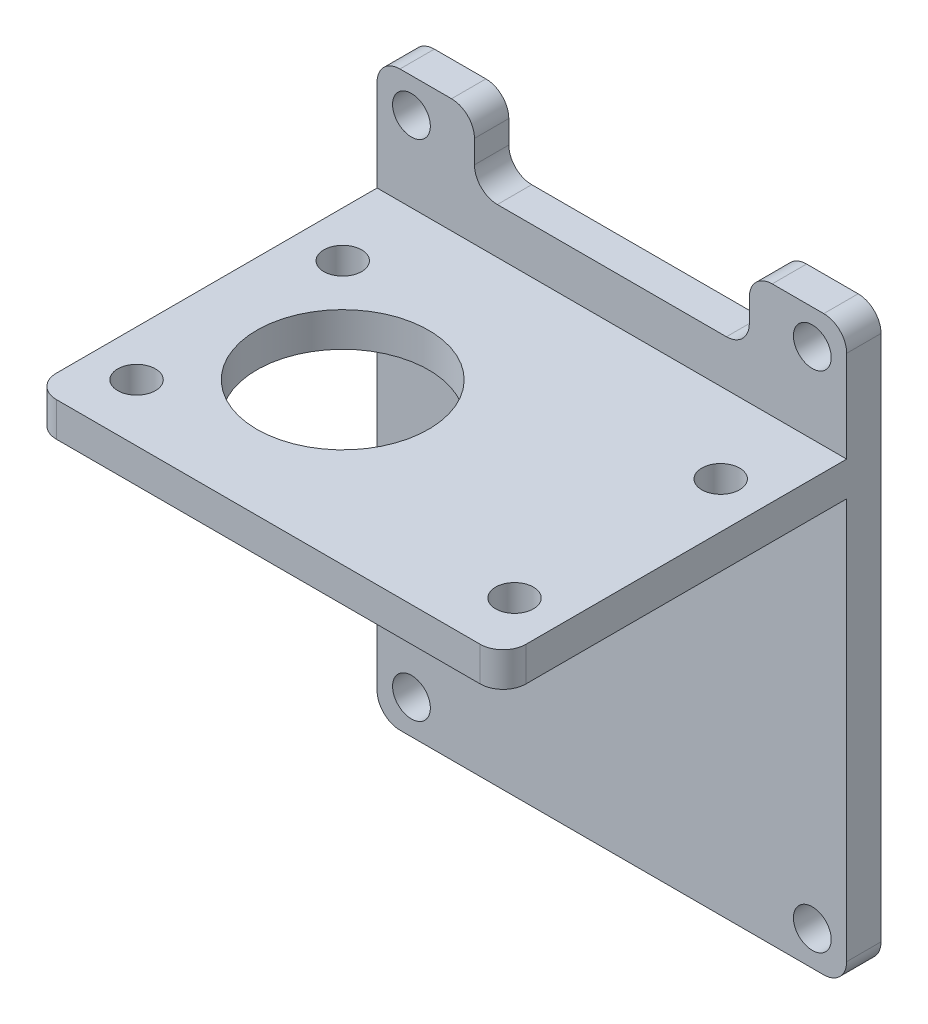
ISO-10303-21;
HEADER;
FILE_DESCRIPTION(('STEP AP214'),'2;1');
FILE_NAME('part.step','',(''),(''),'','','');
FILE_SCHEMA(('AUTOMOTIVE_DESIGN { 1 0 10303 214 1 1 1 1 }'));
ENDSEC;
DATA;
#1=APPLICATION_CONTEXT('core data for automotive mechanical design processes');
#2=APPLICATION_PROTOCOL_DEFINITION('international standard','automotive_design',2000,#1);
#3=PRODUCT_CONTEXT('',#1,'mechanical');
#4=PRODUCT('Part','Part','',(#3));
#5=PRODUCT_RELATED_PRODUCT_CATEGORY('part','',(#4));
#6=PRODUCT_DEFINITION_FORMATION('','',#4);
#7=PRODUCT_DEFINITION_CONTEXT('part definition',#1,'design');
#8=PRODUCT_DEFINITION('design','',#6,#7);
#9=PRODUCT_DEFINITION_SHAPE('','',#8);
#10=(LENGTH_UNIT() NAMED_UNIT(*) SI_UNIT(.MILLI.,.METRE.));
#11=(NAMED_UNIT(*) PLANE_ANGLE_UNIT() SI_UNIT($,.RADIAN.));
#12=(NAMED_UNIT(*) SI_UNIT($,.STERADIAN.) SOLID_ANGLE_UNIT());
#13=UNCERTAINTY_MEASURE_WITH_UNIT(LENGTH_MEASURE(1.E-05),#10,'distance_accuracy_value','');
#14=(GEOMETRIC_REPRESENTATION_CONTEXT(3) GLOBAL_UNCERTAINTY_ASSIGNED_CONTEXT((#13)) GLOBAL_UNIT_ASSIGNED_CONTEXT((#10,
#11,#12)) REPRESENTATION_CONTEXT('',''));
#15=CARTESIAN_POINT('',(0.,0.,0.));
#16=DIRECTION('',(0.,0.,1.));
#17=DIRECTION('',(1.,0.,0.));
#18=AXIS2_PLACEMENT_3D('',#15,#16,#17);
#19=CARTESIAN_POINT('',(-3.,47.,3.));
#20=DIRECTION('',(0.,-1.,0.));
#21=DIRECTION('',(0.,0.,-1.));
#22=AXIS2_PLACEMENT_3D('',#19,#20,#21);
#23=PLANE('',#22);
#24=DIRECTION('',(-1.,0.,0.));
#25=VECTOR('',#24,1.);
#26=CARTESIAN_POINT('',(-3.,47.,0.));
#27=LINE('',#26,#25);
#28=CARTESIAN_POINT('',(36.,47.,0.));
#29=VERTEX_POINT('',#28);
#30=CARTESIAN_POINT('',(31.5,47.,0.));
#31=VERTEX_POINT('',#30);
#32=EDGE_CURVE('E275',#29,#31,#27,.T.);
#33=ORIENTED_EDGE('',*,*,#32,.T.);
#34=DIRECTION('',(0.,0.,1.));
#35=VECTOR('',#34,1.);
#36=CARTESIAN_POINT('',(31.5,47.,3.));
#37=LINE('',#36,#35);
#38=CARTESIAN_POINT('',(31.5,47.,3.));
#39=VERTEX_POINT('',#38);
#40=EDGE_CURVE('E353',#31,#39,#37,.T.);
#41=ORIENTED_EDGE('',*,*,#40,.T.);
#42=DIRECTION('',(-1.,0.,0.));
#43=VECTOR('',#42,1.);
#44=CARTESIAN_POINT('',(-3.,47.,3.));
#45=LINE('',#44,#43);
#46=CARTESIAN_POINT('',(36.,47.,3.));
#47=VERTEX_POINT('',#46);
#48=EDGE_CURVE('E260',#47,#39,#45,.T.);
#49=ORIENTED_EDGE('',*,*,#48,.F.);
#50=DIRECTION('',(0.,0.,-1.));
#51=VECTOR('',#50,1.);
#52=CARTESIAN_POINT('',(36.,47.,3.));
#53=LINE('',#52,#51);
#54=EDGE_CURVE('E350',#47,#29,#53,.T.);
#55=ORIENTED_EDGE('',*,*,#54,.T.);
#56=EDGE_LOOP('',(#33,#41,#49,#55));
#57=FACE_BOUND('',#56,.T.);
#58=ADVANCED_FACE('F34',(#57),#23,.F.);
#59=CARTESIAN_POINT('',(0.,0.,3.));
#60=DIRECTION('',(0.,0.,-1.));
#61=DIRECTION('',(-1.,0.,0.));
#62=AXIS2_PLACEMENT_3D('',#59,#60,#61);
#63=PLANE('',#62);
#64=CARTESIAN_POINT('',(35.,44.,3.));
#65=DIRECTION('',(0.,0.,1.));
#66=DIRECTION('',(1.,0.,0.));
#67=AXIS2_PLACEMENT_3D('',#64,#65,#66);
#68=CIRCLE('',#67,1.65);
#69=CARTESIAN_POINT('',(36.65,44.,3.));
#70=VERTEX_POINT('',#69);
#71=EDGE_CURVE('E243',#70,#70,#68,.T.);
#72=ORIENTED_EDGE('',*,*,#71,.F.);
#73=EDGE_LOOP('',(#72));
#74=FACE_BOUND('',#73,.T.);
#75=CARTESIAN_POINT('',(0.,44.,3.));
#76=DIRECTION('',(0.,0.,1.));
#77=DIRECTION('',(1.,0.,0.));
#78=AXIS2_PLACEMENT_3D('',#75,#76,#77);
#79=CIRCLE('',#78,1.65);
#80=CARTESIAN_POINT('',(1.65,44.,3.));
#81=VERTEX_POINT('',#80);
#82=EDGE_CURVE('E249',#81,#81,#79,.T.);
#83=ORIENTED_EDGE('',*,*,#82,.F.);
#84=EDGE_LOOP('',(#83));
#85=FACE_BOUND('',#84,.T.);
#86=CARTESIAN_POINT('',(3.5,47.,3.));
#87=VERTEX_POINT('',#86);
#88=CARTESIAN_POINT('',(-1.,47.,3.));
#89=VERTEX_POINT('',#88);
#90=EDGE_CURVE('E196',#87,#89,#45,.T.);
#91=ORIENTED_EDGE('',*,*,#90,.T.);
#92=CARTESIAN_POINT('',(-1.,45.,3.));
#93=DIRECTION('',(0.,0.,-1.));
#94=DIRECTION('',(-1.,0.,0.));
#95=AXIS2_PLACEMENT_3D('',#92,#93,#94);
#96=CIRCLE('',#95,2.);
#97=CARTESIAN_POINT('',(-3.,45.,3.));
#98=VERTEX_POINT('',#97);
#99=EDGE_CURVE('E335',#89,#98,#96,.F.);
#100=ORIENTED_EDGE('',*,*,#99,.T.);
#101=DIRECTION('',(0.,-1.,0.));
#102=VECTOR('',#101,1.);
#103=CARTESIAN_POINT('',(-3.,-3.,3.));
#104=LINE('',#103,#102);
#105=CARTESIAN_POINT('',(-3.,37.,3.));
#106=VERTEX_POINT('',#105);
#107=EDGE_CURVE('E255',#98,#106,#104,.T.);
#108=ORIENTED_EDGE('',*,*,#107,.T.);
#109=DIRECTION('',(-1.,0.,0.));
#110=VECTOR('',#109,1.);
#111=CARTESIAN_POINT('',(-3.,37.,3.));
#112=LINE('',#111,#110);
#113=CARTESIAN_POINT('',(38.,37.,3.));
#114=VERTEX_POINT('',#113);
#115=EDGE_CURVE('E212',#114,#106,#112,.T.);
#116=ORIENTED_EDGE('',*,*,#115,.F.);
#117=DIRECTION('',(0.,1.,0.));
#118=VECTOR('',#117,1.);
#119=CARTESIAN_POINT('',(38.,-3.,3.));
#120=LINE('',#119,#118);
#121=CARTESIAN_POINT('',(38.,45.,3.));
#122=VERTEX_POINT('',#121);
#123=EDGE_CURVE('E197',#114,#122,#120,.T.);
#124=ORIENTED_EDGE('',*,*,#123,.T.);
#125=CARTESIAN_POINT('',(36.,45.,3.));
#126=DIRECTION('',(0.,0.,-1.));
#127=DIRECTION('',(-1.,0.,0.));
#128=AXIS2_PLACEMENT_3D('',#125,#126,#127);
#129=CIRCLE('',#128,2.);
#130=EDGE_CURVE('E329',#122,#47,#129,.F.);
#131=ORIENTED_EDGE('',*,*,#130,.T.);
#132=ORIENTED_EDGE('',*,*,#48,.T.);
#133=CARTESIAN_POINT('',(31.5,45.,3.));
#134=DIRECTION('',(0.,0.,-1.));
#135=DIRECTION('',(-1.,0.,0.));
#136=AXIS2_PLACEMENT_3D('',#133,#134,#135);
#137=CIRCLE('',#136,2.);
#138=CARTESIAN_POINT('',(29.5,45.,3.));
#139=VERTEX_POINT('',#138);
#140=EDGE_CURVE('E331',#39,#139,#137,.F.);
#141=ORIENTED_EDGE('',*,*,#140,.T.);
#142=DIRECTION('',(0.,1.,0.));
#143=VECTOR('',#142,1.);
#144=CARTESIAN_POINT('',(29.5,41.,3.));
#145=LINE('',#144,#143);
#146=CARTESIAN_POINT('',(29.5,43.,3.));
#147=VERTEX_POINT('',#146);
#148=EDGE_CURVE('E364',#147,#139,#145,.T.);
#149=ORIENTED_EDGE('',*,*,#148,.F.);
#150=CARTESIAN_POINT('',(27.5,43.,3.));
#151=DIRECTION('',(0.,0.,-1.));
#152=DIRECTION('',(-1.,0.,0.));
#153=AXIS2_PLACEMENT_3D('',#150,#151,#152);
#154=CIRCLE('',#153,2.);
#155=CARTESIAN_POINT('',(27.5,41.,3.));
#156=VERTEX_POINT('',#155);
#157=EDGE_CURVE('E42',#147,#156,#154,.T.);
#158=ORIENTED_EDGE('',*,*,#157,.T.);
#159=DIRECTION('',(1.,0.,0.));
#160=VECTOR('',#159,1.);
#161=CARTESIAN_POINT('',(5.5,41.,3.));
#162=LINE('',#161,#160);
#163=CARTESIAN_POINT('',(7.5,41.,3.));
#164=VERTEX_POINT('',#163);
#165=EDGE_CURVE('E362',#164,#156,#162,.T.);
#166=ORIENTED_EDGE('',*,*,#165,.F.);
#167=CARTESIAN_POINT('',(7.5,43.,3.));
#168=DIRECTION('',(0.,0.,-1.));
#169=DIRECTION('',(-1.,0.,0.));
#170=AXIS2_PLACEMENT_3D('',#167,#168,#169);
#171=CIRCLE('',#170,2.);
#172=CARTESIAN_POINT('',(5.5,43.,3.));
#173=VERTEX_POINT('',#172);
#174=EDGE_CURVE('E49',#164,#173,#171,.T.);
#175=ORIENTED_EDGE('',*,*,#174,.T.);
#176=DIRECTION('',(0.,-1.,0.));
#177=VECTOR('',#176,1.);
#178=CARTESIAN_POINT('',(5.5,41.,3.));
#179=LINE('',#178,#177);
#180=CARTESIAN_POINT('',(5.5,45.,3.));
#181=VERTEX_POINT('',#180);
#182=EDGE_CURVE('E373',#181,#173,#179,.T.);
#183=ORIENTED_EDGE('',*,*,#182,.F.);
#184=CARTESIAN_POINT('',(3.5,45.,3.));
#185=DIRECTION('',(0.,0.,-1.));
#186=DIRECTION('',(-1.,0.,0.));
#187=AXIS2_PLACEMENT_3D('',#184,#185,#186);
#188=CIRCLE('',#187,2.);
#189=EDGE_CURVE('E333',#181,#87,#188,.F.);
#190=ORIENTED_EDGE('',*,*,#189,.T.);
#191=EDGE_LOOP('',(#91,#100,#108,#116,#124,#131,#132,#141,#149,#158,#166,#175,#183,#190));
#192=FACE_BOUND('',#191,.T.);
#193=ADVANCED_FACE('F361',(#74,#85,#192),#63,.F.);
#194=CARTESIAN_POINT('',(0.,0.,3.));
#195=DIRECTION('',(0.,0.,1.));
#196=DIRECTION('',(1.,0.,0.));
#197=AXIS2_PLACEMENT_3D('',#194,#195,#196);
#198=CIRCLE('',#197,1.65);
#199=CARTESIAN_POINT('',(1.65,0.,3.));
#200=VERTEX_POINT('',#199);
#201=EDGE_CURVE('E231',#200,#200,#198,.T.);
#202=ORIENTED_EDGE('',*,*,#201,.F.);
#203=EDGE_LOOP('',(#202));
#204=FACE_BOUND('',#203,.T.);
#205=CARTESIAN_POINT('',(35.,0.,3.));
#206=DIRECTION('',(0.,0.,1.));
#207=DIRECTION('',(1.,0.,0.));
#208=AXIS2_PLACEMENT_3D('',#205,#206,#207);
#209=CIRCLE('',#208,1.65);
#210=CARTESIAN_POINT('',(36.65,0.,3.));
#211=VERTEX_POINT('',#210);
#212=EDGE_CURVE('E237',#211,#211,#209,.T.);
#213=ORIENTED_EDGE('',*,*,#212,.F.);
#214=EDGE_LOOP('',(#213));
#215=FACE_BOUND('',#214,.T.);
#216=DIRECTION('',(1.,0.,0.));
#217=VECTOR('',#216,1.);
#218=CARTESIAN_POINT('',(-3.,-3.,3.));
#219=LINE('',#218,#217);
#220=CARTESIAN_POINT('',(-1.,-3.,3.));
#221=VERTEX_POINT('',#220);
#222=CARTESIAN_POINT('',(36.,-3.,3.));
#223=VERTEX_POINT('',#222);
#224=EDGE_CURVE('E257',#221,#223,#219,.T.);
#225=ORIENTED_EDGE('',*,*,#224,.T.);
#226=CARTESIAN_POINT('',(36.,-1.,3.));
#227=DIRECTION('',(0.,0.,-1.));
#228=DIRECTION('',(-1.,0.,0.));
#229=AXIS2_PLACEMENT_3D('',#226,#227,#228);
#230=CIRCLE('',#229,2.);
#231=CARTESIAN_POINT('',(38.,-1.,3.));
#232=VERTEX_POINT('',#231);
#233=EDGE_CURVE('E192',#223,#232,#230,.F.);
#234=ORIENTED_EDGE('',*,*,#233,.T.);
#235=CARTESIAN_POINT('',(38.,34.,3.));
#236=VERTEX_POINT('',#235);
#237=EDGE_CURVE('E183',#232,#236,#120,.T.);
#238=ORIENTED_EDGE('',*,*,#237,.T.);
#239=DIRECTION('',(1.,0.,0.));
#240=VECTOR('',#239,1.);
#241=CARTESIAN_POINT('',(-3.,34.,3.));
#242=LINE('',#241,#240);
#243=CARTESIAN_POINT('',(-3.,34.,3.));
#244=VERTEX_POINT('',#243);
#245=EDGE_CURVE('E189',#244,#236,#242,.T.);
#246=ORIENTED_EDGE('',*,*,#245,.F.);
#247=CARTESIAN_POINT('',(-3.,-1.,3.));
#248=VERTEX_POINT('',#247);
#249=EDGE_CURVE('E258',#244,#248,#104,.T.);
#250=ORIENTED_EDGE('',*,*,#249,.T.);
#251=CARTESIAN_POINT('',(-1.,-1.,3.));
#252=DIRECTION('',(0.,0.,-1.));
#253=DIRECTION('',(-1.,0.,0.));
#254=AXIS2_PLACEMENT_3D('',#251,#252,#253);
#255=CIRCLE('',#254,2.);
#256=EDGE_CURVE('E321',#248,#221,#255,.F.);
#257=ORIENTED_EDGE('',*,*,#256,.T.);
#258=EDGE_LOOP('',(#225,#234,#238,#246,#250,#257));
#259=FACE_BOUND('',#258,.T.);
#260=ADVANCED_FACE('F186',(#204,#215,#259),#63,.F.);
#261=CARTESIAN_POINT('',(0.,0.,0.));
#262=DIRECTION('',(0.,0.,-1.));
#263=DIRECTION('',(-1.,0.,0.));
#264=AXIS2_PLACEMENT_3D('',#261,#262,#263);
#265=PLANE('',#264);
#266=DIRECTION('',(0.,1.,0.));
#267=VECTOR('',#266,1.);
#268=CARTESIAN_POINT('',(38.,-3.,0.));
#269=LINE('',#268,#267);
#270=CARTESIAN_POINT('',(38.,-1.,0.));
#271=VERTEX_POINT('',#270);
#272=CARTESIAN_POINT('',(38.,45.,0.));
#273=VERTEX_POINT('',#272);
#274=EDGE_CURVE('E269',#271,#273,#269,.T.);
#275=ORIENTED_EDGE('',*,*,#274,.F.);
#276=CARTESIAN_POINT('',(36.,-1.,0.));
#277=DIRECTION('',(0.,0.,-1.));
#278=DIRECTION('',(-1.,0.,0.));
#279=AXIS2_PLACEMENT_3D('',#276,#277,#278);
#280=CIRCLE('',#279,2.);
#281=CARTESIAN_POINT('',(36.,-3.,0.));
#282=VERTEX_POINT('',#281);
#283=EDGE_CURVE('E314',#271,#282,#280,.T.);
#284=ORIENTED_EDGE('',*,*,#283,.T.);
#285=DIRECTION('',(1.,0.,0.));
#286=VECTOR('',#285,1.);
#287=CARTESIAN_POINT('',(-3.,-3.,0.));
#288=LINE('',#287,#286);
#289=CARTESIAN_POINT('',(-1.,-3.,0.));
#290=VERTEX_POINT('',#289);
#291=EDGE_CURVE('E266',#290,#282,#288,.T.);
#292=ORIENTED_EDGE('',*,*,#291,.F.);
#293=CARTESIAN_POINT('',(-1.,-1.,0.));
#294=DIRECTION('',(0.,0.,-1.));
#295=DIRECTION('',(-1.,0.,0.));
#296=AXIS2_PLACEMENT_3D('',#293,#294,#295);
#297=CIRCLE('',#296,2.);
#298=CARTESIAN_POINT('',(-3.,-1.,0.));
#299=VERTEX_POINT('',#298);
#300=EDGE_CURVE('E312',#290,#299,#297,.T.);
#301=ORIENTED_EDGE('',*,*,#300,.T.);
#302=DIRECTION('',(0.,-1.,0.));
#303=VECTOR('',#302,1.);
#304=CARTESIAN_POINT('',(-3.,-3.,0.));
#305=LINE('',#304,#303);
#306=CARTESIAN_POINT('',(-3.,45.,0.));
#307=VERTEX_POINT('',#306);
#308=EDGE_CURVE('E252',#307,#299,#305,.T.);
#309=ORIENTED_EDGE('',*,*,#308,.F.);
#310=CARTESIAN_POINT('',(-1.,45.,0.));
#311=DIRECTION('',(0.,0.,-1.));
#312=DIRECTION('',(-1.,0.,0.));
#313=AXIS2_PLACEMENT_3D('',#310,#311,#312);
#314=CIRCLE('',#313,2.);
#315=CARTESIAN_POINT('',(-1.,47.,0.));
#316=VERTEX_POINT('',#315);
#317=EDGE_CURVE('E310',#307,#316,#314,.T.);
#318=ORIENTED_EDGE('',*,*,#317,.T.);
#319=CARTESIAN_POINT('',(3.5,47.,0.));
#320=VERTEX_POINT('',#319);
#321=EDGE_CURVE('E272',#320,#316,#27,.T.);
#322=ORIENTED_EDGE('',*,*,#321,.F.);
#323=CARTESIAN_POINT('',(3.5,45.,0.));
#324=DIRECTION('',(0.,0.,-1.));
#325=DIRECTION('',(-1.,0.,0.));
#326=AXIS2_PLACEMENT_3D('',#323,#324,#325);
#327=CIRCLE('',#326,2.);
#328=CARTESIAN_POINT('',(5.5,45.,0.));
#329=VERTEX_POINT('',#328);
#330=EDGE_CURVE('E308',#320,#329,#327,.T.);
#331=ORIENTED_EDGE('',*,*,#330,.T.);
#332=DIRECTION('',(0.,1.,0.));
#333=VECTOR('',#332,1.);
#334=CARTESIAN_POINT('',(5.5,0.,0.));
#335=LINE('',#334,#333);
#336=CARTESIAN_POINT('',(5.5,43.,0.));
#337=VERTEX_POINT('',#336);
#338=EDGE_CURVE('E372',#337,#329,#335,.T.);
#339=ORIENTED_EDGE('',*,*,#338,.F.);
#340=CARTESIAN_POINT('',(7.5,43.,0.));
#341=DIRECTION('',(0.,0.,-1.));
#342=DIRECTION('',(-1.,0.,0.));
#343=AXIS2_PLACEMENT_3D('',#340,#341,#342);
#344=CIRCLE('',#343,2.);
#345=CARTESIAN_POINT('',(7.5,41.,0.));
#346=VERTEX_POINT('',#345);
#347=EDGE_CURVE('E357',#337,#346,#344,.F.);
#348=ORIENTED_EDGE('',*,*,#347,.T.);
#349=DIRECTION('',(-1.,0.,0.));
#350=VECTOR('',#349,1.);
#351=CARTESIAN_POINT('',(0.,41.,0.));
#352=LINE('',#351,#350);
#353=CARTESIAN_POINT('',(27.5,41.,0.));
#354=VERTEX_POINT('',#353);
#355=EDGE_CURVE('E263',#354,#346,#352,.T.);
#356=ORIENTED_EDGE('',*,*,#355,.F.);
#357=CARTESIAN_POINT('',(27.5,43.,0.));
#358=DIRECTION('',(0.,0.,-1.));
#359=DIRECTION('',(-1.,0.,0.));
#360=AXIS2_PLACEMENT_3D('',#357,#358,#359);
#361=CIRCLE('',#360,2.);
#362=CARTESIAN_POINT('',(29.5,43.,0.));
#363=VERTEX_POINT('',#362);
#364=EDGE_CURVE('E11',#354,#363,#361,.F.);
#365=ORIENTED_EDGE('',*,*,#364,.T.);
#366=DIRECTION('',(0.,-1.,0.));
#367=VECTOR('',#366,1.);
#368=CARTESIAN_POINT('',(29.5,0.,0.));
#369=LINE('',#368,#367);
#370=CARTESIAN_POINT('',(29.5,45.,0.));
#371=VERTEX_POINT('',#370);
#372=EDGE_CURVE('E383',#371,#363,#369,.T.);
#373=ORIENTED_EDGE('',*,*,#372,.F.);
#374=CARTESIAN_POINT('',(31.5,45.,0.));
#375=DIRECTION('',(0.,0.,-1.));
#376=DIRECTION('',(-1.,0.,0.));
#377=AXIS2_PLACEMENT_3D('',#374,#375,#376);
#378=CIRCLE('',#377,2.);
#379=EDGE_CURVE('E306',#371,#31,#378,.T.);
#380=ORIENTED_EDGE('',*,*,#379,.T.);
#381=ORIENTED_EDGE('',*,*,#32,.F.);
#382=CARTESIAN_POINT('',(36.,45.,0.));
#383=DIRECTION('',(0.,0.,-1.));
#384=DIRECTION('',(-1.,0.,0.));
#385=AXIS2_PLACEMENT_3D('',#382,#383,#384);
#386=CIRCLE('',#385,2.);
#387=EDGE_CURVE('E304',#29,#273,#386,.T.);
#388=ORIENTED_EDGE('',*,*,#387,.T.);
#389=EDGE_LOOP('',(#275,#284,#292,#301,#309,#318,#322,#331,#339,#348,#356,#365,#373,#380,#381,#388));
#390=FACE_BOUND('',#389,.T.);
#391=CARTESIAN_POINT('',(35.,0.,0.));
#392=DIRECTION('',(0.,0.,1.));
#393=DIRECTION('',(1.,0.,0.));
#394=AXIS2_PLACEMENT_3D('',#391,#392,#393);
#395=CIRCLE('',#394,1.65);
#396=CARTESIAN_POINT('',(36.65,0.,0.));
#397=VERTEX_POINT('',#396);
#398=EDGE_CURVE('E234',#397,#397,#395,.T.);
#399=ORIENTED_EDGE('',*,*,#398,.T.);
#400=EDGE_LOOP('',(#399));
#401=FACE_BOUND('',#400,.T.);
#402=CARTESIAN_POINT('',(0.,44.,0.));
#403=DIRECTION('',(0.,0.,1.));
#404=DIRECTION('',(1.,0.,0.));
#405=AXIS2_PLACEMENT_3D('',#402,#403,#404);
#406=CIRCLE('',#405,1.65);
#407=CARTESIAN_POINT('',(1.65,44.,0.));
#408=VERTEX_POINT('',#407);
#409=EDGE_CURVE('E246',#408,#408,#406,.T.);
#410=ORIENTED_EDGE('',*,*,#409,.T.);
#411=EDGE_LOOP('',(#410));
#412=FACE_BOUND('',#411,.T.);
#413=CARTESIAN_POINT('',(35.,44.,0.));
#414=DIRECTION('',(0.,0.,1.));
#415=DIRECTION('',(1.,0.,0.));
#416=AXIS2_PLACEMENT_3D('',#413,#414,#415);
#417=CIRCLE('',#416,1.65);
#418=CARTESIAN_POINT('',(36.65,44.,0.));
#419=VERTEX_POINT('',#418);
#420=EDGE_CURVE('E240',#419,#419,#417,.T.);
#421=ORIENTED_EDGE('',*,*,#420,.T.);
#422=EDGE_LOOP('',(#421));
#423=FACE_BOUND('',#422,.T.);
#424=CARTESIAN_POINT('',(0.,0.,0.));
#425=DIRECTION('',(0.,0.,1.));
#426=DIRECTION('',(1.,0.,0.));
#427=AXIS2_PLACEMENT_3D('',#424,#425,#426);
#428=CIRCLE('',#427,1.65);
#429=CARTESIAN_POINT('',(1.65,0.,0.));
#430=VERTEX_POINT('',#429);
#431=EDGE_CURVE('E230',#430,#430,#428,.T.);
#432=ORIENTED_EDGE('',*,*,#431,.T.);
#433=EDGE_LOOP('',(#432));
#434=FACE_BOUND('',#433,.T.);
#435=ADVANCED_FACE('F381',(#390,#401,#412,#423,#434),#265,.T.);
#436=CARTESIAN_POINT('',(-3.,-3.,3.));
#437=DIRECTION('',(1.,0.,0.));
#438=DIRECTION('',(0.,0.,-1.));
#439=AXIS2_PLACEMENT_3D('',#436,#437,#438);
#440=PLANE('',#439);
#441=DIRECTION('',(0.,0.,-1.));
#442=VECTOR('',#441,1.);
#443=CARTESIAN_POINT('',(-3.,34.,33.));
#444=LINE('',#443,#442);
#445=CARTESIAN_POINT('',(-3.,34.,31.));
#446=VERTEX_POINT('',#445);
#447=EDGE_CURVE('E207',#446,#244,#444,.T.);
#448=ORIENTED_EDGE('',*,*,#447,.F.);
#449=DIRECTION('',(0.,-1.,0.));
#450=VECTOR('',#449,1.);
#451=CARTESIAN_POINT('',(-3.,37.,31.));
#452=LINE('',#451,#450);
#453=CARTESIAN_POINT('',(-3.,37.,31.));
#454=VERTEX_POINT('',#453);
#455=EDGE_CURVE('E302',#446,#454,#452,.F.);
#456=ORIENTED_EDGE('',*,*,#455,.T.);
#457=DIRECTION('',(0.,0.,-1.));
#458=VECTOR('',#457,1.);
#459=CARTESIAN_POINT('',(-3.,37.,33.));
#460=LINE('',#459,#458);
#461=EDGE_CURVE('E225',#454,#106,#460,.T.);
#462=ORIENTED_EDGE('',*,*,#461,.T.);
#463=ORIENTED_EDGE('',*,*,#107,.F.);
#464=DIRECTION('',(0.,0.,-1.));
#465=VECTOR('',#464,1.);
#466=CARTESIAN_POINT('',(-3.,45.,3.));
#467=LINE('',#466,#465);
#468=EDGE_CURVE('E297',#98,#307,#467,.T.);
#469=ORIENTED_EDGE('',*,*,#468,.T.);
#470=ORIENTED_EDGE('',*,*,#308,.T.);
#471=DIRECTION('',(0.,0.,-1.));
#472=VECTOR('',#471,1.);
#473=CARTESIAN_POINT('',(-3.,-1.,3.));
#474=LINE('',#473,#472);
#475=EDGE_CURVE('E300',#299,#248,#474,.F.);
#476=ORIENTED_EDGE('',*,*,#475,.T.);
#477=ORIENTED_EDGE('',*,*,#249,.F.);
#478=EDGE_LOOP('',(#448,#456,#462,#463,#469,#470,#476,#477));
#479=FACE_BOUND('',#478,.T.);
#480=ADVANCED_FACE('F430',(#479),#440,.F.);
#481=CARTESIAN_POINT('',(-3.,-3.,3.));
#482=DIRECTION('',(0.,1.,0.));
#483=DIRECTION('',(0.,0.,1.));
#484=AXIS2_PLACEMENT_3D('',#481,#482,#483);
#485=PLANE('',#484);
#486=ORIENTED_EDGE('',*,*,#291,.T.);
#487=DIRECTION('',(0.,0.,-1.));
#488=VECTOR('',#487,1.);
#489=CARTESIAN_POINT('',(36.,-3.,3.));
#490=LINE('',#489,#488);
#491=EDGE_CURVE('E319',#282,#223,#490,.F.);
#492=ORIENTED_EDGE('',*,*,#491,.T.);
#493=ORIENTED_EDGE('',*,*,#224,.F.);
#494=DIRECTION('',(0.,0.,-1.));
#495=VECTOR('',#494,1.);
#496=CARTESIAN_POINT('',(-1.,-3.,3.));
#497=LINE('',#496,#495);
#498=EDGE_CURVE('E316',#221,#290,#497,.T.);
#499=ORIENTED_EDGE('',*,*,#498,.T.);
#500=EDGE_LOOP('',(#486,#492,#493,#499));
#501=FACE_BOUND('',#500,.T.);
#502=ADVANCED_FACE('F476',(#501),#485,.F.);
#503=CARTESIAN_POINT('',(38.,-3.,3.));
#504=DIRECTION('',(-1.,0.,0.));
#505=DIRECTION('',(0.,0.,1.));
#506=AXIS2_PLACEMENT_3D('',#503,#504,#505);
#507=PLANE('',#506);
#508=DIRECTION('',(0.,0.,-1.));
#509=VECTOR('',#508,1.);
#510=CARTESIAN_POINT('',(38.,37.,33.));
#511=LINE('',#510,#509);
#512=CARTESIAN_POINT('',(38.,37.,31.));
#513=VERTEX_POINT('',#512);
#514=EDGE_CURVE('E208',#513,#114,#511,.T.);
#515=ORIENTED_EDGE('',*,*,#514,.F.);
#516=DIRECTION('',(0.,1.,0.));
#517=VECTOR('',#516,1.);
#518=CARTESIAN_POINT('',(38.,34.,31.));
#519=LINE('',#518,#517);
#520=CARTESIAN_POINT('',(38.,34.,31.));
#521=VERTEX_POINT('',#520);
#522=EDGE_CURVE('E204',#513,#521,#519,.F.);
#523=ORIENTED_EDGE('',*,*,#522,.T.);
#524=DIRECTION('',(0.,0.,-1.));
#525=VECTOR('',#524,1.);
#526=CARTESIAN_POINT('',(38.,34.,33.));
#527=LINE('',#526,#525);
#528=EDGE_CURVE('E200',#521,#236,#527,.T.);
#529=ORIENTED_EDGE('',*,*,#528,.T.);
#530=ORIENTED_EDGE('',*,*,#237,.F.);
#531=DIRECTION('',(0.,0.,-1.));
#532=VECTOR('',#531,1.);
#533=CARTESIAN_POINT('',(38.,-1.,3.));
#534=LINE('',#533,#532);
#535=EDGE_CURVE('E290',#232,#271,#534,.T.);
#536=ORIENTED_EDGE('',*,*,#535,.T.);
#537=ORIENTED_EDGE('',*,*,#274,.T.);
#538=DIRECTION('',(0.,0.,-1.));
#539=VECTOR('',#538,1.);
#540=CARTESIAN_POINT('',(38.,45.,3.));
#541=LINE('',#540,#539);
#542=EDGE_CURVE('E288',#273,#122,#541,.F.);
#543=ORIENTED_EDGE('',*,*,#542,.T.);
#544=ORIENTED_EDGE('',*,*,#123,.F.);
#545=EDGE_LOOP('',(#515,#523,#529,#530,#536,#537,#543,#544));
#546=FACE_BOUND('',#545,.T.);
#547=ADVANCED_FACE('F202',(#546),#507,.F.);
#548=ORIENTED_EDGE('',*,*,#321,.T.);
#549=DIRECTION('',(0.,0.,-1.));
#550=VECTOR('',#549,1.);
#551=CARTESIAN_POINT('',(-1.,47.,3.));
#552=LINE('',#551,#550);
#553=EDGE_CURVE('E327',#316,#89,#552,.F.);
#554=ORIENTED_EDGE('',*,*,#553,.T.);
#555=ORIENTED_EDGE('',*,*,#90,.F.);
#556=DIRECTION('',(0.,0.,-1.));
#557=VECTOR('',#556,1.);
#558=CARTESIAN_POINT('',(3.5,47.,3.));
#559=LINE('',#558,#557);
#560=EDGE_CURVE('E324',#87,#320,#559,.T.);
#561=ORIENTED_EDGE('',*,*,#560,.T.);
#562=EDGE_LOOP('',(#548,#554,#555,#561));
#563=FACE_BOUND('',#562,.T.);
#564=ADVANCED_FACE('F458',(#563),#23,.F.);
#565=CARTESIAN_POINT('',(0.,44.,3.));
#566=DIRECTION('',(0.,0.,-1.));
#567=DIRECTION('',(-1.,0.,0.));
#568=AXIS2_PLACEMENT_3D('',#565,#566,#567);
#569=CYLINDRICAL_SURFACE('',#568,1.65);
#570=ORIENTED_EDGE('',*,*,#82,.T.);
#571=EDGE_LOOP('',(#570));
#572=FACE_BOUND('',#571,.T.);
#573=ORIENTED_EDGE('',*,*,#409,.F.);
#574=EDGE_LOOP('',(#573));
#575=FACE_BOUND('',#574,.T.);
#576=ADVANCED_FACE('F501',(#572,#575),#569,.F.);
#577=CARTESIAN_POINT('',(35.,44.,3.));
#578=DIRECTION('',(0.,0.,-1.));
#579=DIRECTION('',(-1.,0.,0.));
#580=AXIS2_PLACEMENT_3D('',#577,#578,#579);
#581=CYLINDRICAL_SURFACE('',#580,1.65);
#582=ORIENTED_EDGE('',*,*,#71,.T.);
#583=EDGE_LOOP('',(#582));
#584=FACE_BOUND('',#583,.T.);
#585=ORIENTED_EDGE('',*,*,#420,.F.);
#586=EDGE_LOOP('',(#585));
#587=FACE_BOUND('',#586,.T.);
#588=ADVANCED_FACE('F506',(#584,#587),#581,.F.);
#589=CARTESIAN_POINT('',(35.,0.,3.));
#590=DIRECTION('',(0.,0.,-1.));
#591=DIRECTION('',(-1.,0.,0.));
#592=AXIS2_PLACEMENT_3D('',#589,#590,#591);
#593=CYLINDRICAL_SURFACE('',#592,1.65);
#594=ORIENTED_EDGE('',*,*,#212,.T.);
#595=EDGE_LOOP('',(#594));
#596=FACE_BOUND('',#595,.T.);
#597=ORIENTED_EDGE('',*,*,#398,.F.);
#598=EDGE_LOOP('',(#597));
#599=FACE_BOUND('',#598,.T.);
#600=ADVANCED_FACE('F560',(#596,#599),#593,.F.);
#601=CARTESIAN_POINT('',(0.,0.,3.));
#602=DIRECTION('',(0.,0.,-1.));
#603=DIRECTION('',(-1.,0.,0.));
#604=AXIS2_PLACEMENT_3D('',#601,#602,#603);
#605=CYLINDRICAL_SURFACE('',#604,1.65);
#606=ORIENTED_EDGE('',*,*,#201,.T.);
#607=EDGE_LOOP('',(#606));
#608=FACE_BOUND('',#607,.T.);
#609=ORIENTED_EDGE('',*,*,#431,.F.);
#610=EDGE_LOOP('',(#609));
#611=FACE_BOUND('',#610,.T.);
#612=ADVANCED_FACE('F556',(#608,#611),#605,.F.);
#613=CARTESIAN_POINT('',(-3.,34.,33.));
#614=DIRECTION('',(0.,1.,0.));
#615=DIRECTION('',(0.,0.,1.));
#616=AXIS2_PLACEMENT_3D('',#613,#614,#615);
#617=PLANE('',#616);
#618=CARTESIAN_POINT('',(34.,34.,10.));
#619=DIRECTION('',(0.,1.,0.));
#620=DIRECTION('',(0.,0.,1.));
#621=AXIS2_PLACEMENT_3D('',#618,#619,#620);
#622=CIRCLE('',#621,1.65);
#623=CARTESIAN_POINT('',(34.,34.,11.65));
#624=VERTEX_POINT('',#623);
#625=EDGE_CURVE('E213',#624,#624,#622,.T.);
#626=ORIENTED_EDGE('',*,*,#625,.T.);
#627=EDGE_LOOP('',(#626));
#628=FACE_BOUND('',#627,.T.);
#629=CARTESIAN_POINT('',(1.,34.,9.99999999999999));
#630=DIRECTION('',(0.,1.,0.));
#631=DIRECTION('',(0.,0.,1.));
#632=AXIS2_PLACEMENT_3D('',#629,#630,#631);
#633=CIRCLE('',#632,1.65);
#634=CARTESIAN_POINT('',(1.,34.,11.65));
#635=VERTEX_POINT('',#634);
#636=EDGE_CURVE('E219',#635,#635,#633,.T.);
#637=ORIENTED_EDGE('',*,*,#636,.T.);
#638=EDGE_LOOP('',(#637));
#639=FACE_BOUND('',#638,.T.);
#640=CARTESIAN_POINT('',(10.,34.,19.));
#641=DIRECTION('',(0.,1.,0.));
#642=DIRECTION('',(0.,0.,1.));
#643=AXIS2_PLACEMENT_3D('',#640,#641,#642);
#644=CIRCLE('',#643,7.5);
#645=CARTESIAN_POINT('',(10.,34.,26.5));
#646=VERTEX_POINT('',#645);
#647=EDGE_CURVE('E412',#646,#646,#644,.T.);
#648=ORIENTED_EDGE('',*,*,#647,.T.);
#649=EDGE_LOOP('',(#648));
#650=FACE_BOUND('',#649,.T.);
#651=CARTESIAN_POINT('',(1.,34.,28.));
#652=DIRECTION('',(0.,1.,0.));
#653=DIRECTION('',(0.,0.,1.));
#654=AXIS2_PLACEMENT_3D('',#651,#652,#653);
#655=CIRCLE('',#654,1.65);
#656=CARTESIAN_POINT('',(1.,34.,29.65));
#657=VERTEX_POINT('',#656);
#658=EDGE_CURVE('E409',#657,#657,#655,.T.);
#659=ORIENTED_EDGE('',*,*,#658,.T.);
#660=EDGE_LOOP('',(#659));
#661=FACE_BOUND('',#660,.T.);
#662=CARTESIAN_POINT('',(34.,34.,28.));
#663=DIRECTION('',(0.,1.,0.));
#664=DIRECTION('',(0.,0.,1.));
#665=AXIS2_PLACEMENT_3D('',#662,#663,#664);
#666=CIRCLE('',#665,1.65);
#667=CARTESIAN_POINT('',(34.,34.,29.65));
#668=VERTEX_POINT('',#667);
#669=EDGE_CURVE('E406',#668,#668,#666,.T.);
#670=ORIENTED_EDGE('',*,*,#669,.T.);
#671=EDGE_LOOP('',(#670));
#672=FACE_BOUND('',#671,.T.);
#673=ORIENTED_EDGE('',*,*,#528,.F.);
#674=CARTESIAN_POINT('',(36.,34.,31.));
#675=DIRECTION('',(0.,1.,0.));
#676=DIRECTION('',(0.,0.,1.));
#677=AXIS2_PLACEMENT_3D('',#674,#675,#676);
#678=CIRCLE('',#677,2.);
#679=CARTESIAN_POINT('',(36.,34.,33.));
#680=VERTEX_POINT('',#679);
#681=EDGE_CURVE('E295',#521,#680,#678,.F.);
#682=ORIENTED_EDGE('',*,*,#681,.T.);
#683=DIRECTION('',(1.,0.,0.));
#684=VECTOR('',#683,1.);
#685=CARTESIAN_POINT('',(-3.,34.,33.));
#686=LINE('',#685,#684);
#687=CARTESIAN_POINT('',(-1.,34.,33.));
#688=VERTEX_POINT('',#687);
#689=EDGE_CURVE('E216',#688,#680,#686,.T.);
#690=ORIENTED_EDGE('',*,*,#689,.F.);
#691=CARTESIAN_POINT('',(-1.,34.,31.));
#692=DIRECTION('',(0.,1.,0.));
#693=DIRECTION('',(0.,0.,1.));
#694=AXIS2_PLACEMENT_3D('',#691,#692,#693);
#695=CIRCLE('',#694,2.);
#696=EDGE_CURVE('E293',#688,#446,#695,.F.);
#697=ORIENTED_EDGE('',*,*,#696,.T.);
#698=ORIENTED_EDGE('',*,*,#447,.T.);
#699=ORIENTED_EDGE('',*,*,#245,.T.);
#700=EDGE_LOOP('',(#673,#682,#690,#697,#698,#699));
#701=FACE_BOUND('',#700,.T.);
#702=ADVANCED_FACE('F210',(#628,#639,#650,#661,#672,#701),#617,.F.);
#703=CARTESIAN_POINT('',(-3.,37.,33.));
#704=DIRECTION('',(0.,-1.,0.));
#705=DIRECTION('',(0.,0.,-1.));
#706=AXIS2_PLACEMENT_3D('',#703,#704,#705);
#707=PLANE('',#706);
#708=CARTESIAN_POINT('',(34.,37.,10.));
#709=DIRECTION('',(0.,1.,0.));
#710=DIRECTION('',(0.,0.,1.));
#711=AXIS2_PLACEMENT_3D('',#708,#709,#710);
#712=CIRCLE('',#711,1.65);
#713=CARTESIAN_POINT('',(34.,37.,11.65));
#714=VERTEX_POINT('',#713);
#715=EDGE_CURVE('E398',#714,#714,#712,.T.);
#716=ORIENTED_EDGE('',*,*,#715,.F.);
#717=EDGE_LOOP('',(#716));
#718=FACE_BOUND('',#717,.T.);
#719=CARTESIAN_POINT('',(1.,37.,9.99999999999999));
#720=DIRECTION('',(0.,1.,0.));
#721=DIRECTION('',(0.,0.,1.));
#722=AXIS2_PLACEMENT_3D('',#719,#720,#721);
#723=CIRCLE('',#722,1.65);
#724=CARTESIAN_POINT('',(1.,37.,11.65));
#725=VERTEX_POINT('',#724);
#726=EDGE_CURVE('E397',#725,#725,#723,.T.);
#727=ORIENTED_EDGE('',*,*,#726,.F.);
#728=EDGE_LOOP('',(#727));
#729=FACE_BOUND('',#728,.T.);
#730=CARTESIAN_POINT('',(10.,37.,19.));
#731=DIRECTION('',(0.,1.,0.));
#732=DIRECTION('',(0.,0.,1.));
#733=AXIS2_PLACEMENT_3D('',#730,#731,#732);
#734=CIRCLE('',#733,7.5);
#735=CARTESIAN_POINT('',(10.,37.,26.5));
#736=VERTEX_POINT('',#735);
#737=EDGE_CURVE('E388',#736,#736,#734,.T.);
#738=ORIENTED_EDGE('',*,*,#737,.F.);
#739=EDGE_LOOP('',(#738));
#740=FACE_BOUND('',#739,.T.);
#741=CARTESIAN_POINT('',(1.,37.,28.));
#742=DIRECTION('',(0.,1.,0.));
#743=DIRECTION('',(0.,0.,1.));
#744=AXIS2_PLACEMENT_3D('',#741,#742,#743);
#745=CIRCLE('',#744,1.65);
#746=CARTESIAN_POINT('',(1.,37.,29.65));
#747=VERTEX_POINT('',#746);
#748=EDGE_CURVE('E391',#747,#747,#745,.T.);
#749=ORIENTED_EDGE('',*,*,#748,.F.);
#750=EDGE_LOOP('',(#749));
#751=FACE_BOUND('',#750,.T.);
#752=CARTESIAN_POINT('',(34.,37.,28.));
#753=DIRECTION('',(0.,1.,0.));
#754=DIRECTION('',(0.,0.,1.));
#755=AXIS2_PLACEMENT_3D('',#752,#753,#754);
#756=CIRCLE('',#755,1.65);
#757=CARTESIAN_POINT('',(34.,37.,29.65));
#758=VERTEX_POINT('',#757);
#759=EDGE_CURVE('E401',#758,#758,#756,.T.);
#760=ORIENTED_EDGE('',*,*,#759,.F.);
#761=EDGE_LOOP('',(#760));
#762=FACE_BOUND('',#761,.T.);
#763=DIRECTION('',(-1.,0.,0.));
#764=VECTOR('',#763,1.);
#765=CARTESIAN_POINT('',(-3.,37.,33.));
#766=LINE('',#765,#764);
#767=CARTESIAN_POINT('',(36.,37.,33.));
#768=VERTEX_POINT('',#767);
#769=CARTESIAN_POINT('',(-1.,37.,33.));
#770=VERTEX_POINT('',#769);
#771=EDGE_CURVE('E222',#768,#770,#766,.T.);
#772=ORIENTED_EDGE('',*,*,#771,.F.);
#773=CARTESIAN_POINT('',(36.,37.,31.));
#774=DIRECTION('',(0.,-1.,0.));
#775=DIRECTION('',(0.,0.,-1.));
#776=AXIS2_PLACEMENT_3D('',#773,#774,#775);
#777=CIRCLE('',#776,2.);
#778=EDGE_CURVE('E286',#768,#513,#777,.F.);
#779=ORIENTED_EDGE('',*,*,#778,.T.);
#780=ORIENTED_EDGE('',*,*,#514,.T.);
#781=ORIENTED_EDGE('',*,*,#115,.T.);
#782=ORIENTED_EDGE('',*,*,#461,.F.);
#783=CARTESIAN_POINT('',(-1.,37.,31.));
#784=DIRECTION('',(0.,-1.,0.));
#785=DIRECTION('',(0.,0.,-1.));
#786=AXIS2_PLACEMENT_3D('',#783,#784,#785);
#787=CIRCLE('',#786,2.);
#788=EDGE_CURVE('E284',#454,#770,#787,.F.);
#789=ORIENTED_EDGE('',*,*,#788,.T.);
#790=EDGE_LOOP('',(#772,#779,#780,#781,#782,#789));
#791=FACE_BOUND('',#790,.T.);
#792=ADVANCED_FACE('F466',(#718,#729,#740,#751,#762,#791),#707,.F.);
#793=CARTESIAN_POINT('',(0.,0.,33.));
#794=DIRECTION('',(0.,0.,1.));
#795=DIRECTION('',(1.,0.,0.));
#796=AXIS2_PLACEMENT_3D('',#793,#794,#795);
#797=PLANE('',#796);
#798=ORIENTED_EDGE('',*,*,#689,.T.);
#799=DIRECTION('',(0.,1.,0.));
#800=VECTOR('',#799,1.);
#801=CARTESIAN_POINT('',(36.,37.,33.));
#802=LINE('',#801,#800);
#803=EDGE_CURVE('E281',#680,#768,#802,.T.);
#804=ORIENTED_EDGE('',*,*,#803,.T.);
#805=ORIENTED_EDGE('',*,*,#771,.T.);
#806=DIRECTION('',(0.,-1.,0.));
#807=VECTOR('',#806,1.);
#808=CARTESIAN_POINT('',(-1.,34.,33.));
#809=LINE('',#808,#807);
#810=EDGE_CURVE('E278',#770,#688,#809,.T.);
#811=ORIENTED_EDGE('',*,*,#810,.T.);
#812=EDGE_LOOP('',(#798,#804,#805,#811));
#813=FACE_BOUND('',#812,.T.);
#814=ADVANCED_FACE('F423',(#813),#797,.T.);
#815=CARTESIAN_POINT('',(34.,1.99999999999999,28.));
#816=DIRECTION('',(0.,1.,0.));
#817=DIRECTION('',(0.,0.,1.));
#818=AXIS2_PLACEMENT_3D('',#815,#816,#817);
#819=CYLINDRICAL_SURFACE('',#818,1.65);
#820=ORIENTED_EDGE('',*,*,#759,.T.);
#821=EDGE_LOOP('',(#820));
#822=FACE_BOUND('',#821,.T.);
#823=ORIENTED_EDGE('',*,*,#669,.F.);
#824=EDGE_LOOP('',(#823));
#825=FACE_BOUND('',#824,.T.);
#826=ADVANCED_FACE('F538',(#822,#825),#819,.F.);
#827=CARTESIAN_POINT('',(1.,1.99999999999999,28.));
#828=DIRECTION('',(0.,1.,0.));
#829=DIRECTION('',(0.,0.,1.));
#830=AXIS2_PLACEMENT_3D('',#827,#828,#829);
#831=CYLINDRICAL_SURFACE('',#830,1.65);
#832=ORIENTED_EDGE('',*,*,#748,.T.);
#833=EDGE_LOOP('',(#832));
#834=FACE_BOUND('',#833,.T.);
#835=ORIENTED_EDGE('',*,*,#658,.F.);
#836=EDGE_LOOP('',(#835));
#837=FACE_BOUND('',#836,.T.);
#838=ADVANCED_FACE('F534',(#834,#837),#831,.F.);
#839=CARTESIAN_POINT('',(10.,1.99999999999999,19.));
#840=DIRECTION('',(0.,1.,0.));
#841=DIRECTION('',(0.,0.,1.));
#842=AXIS2_PLACEMENT_3D('',#839,#840,#841);
#843=CYLINDRICAL_SURFACE('',#842,7.5);
#844=ORIENTED_EDGE('',*,*,#737,.T.);
#845=EDGE_LOOP('',(#844));
#846=FACE_BOUND('',#845,.T.);
#847=ORIENTED_EDGE('',*,*,#647,.F.);
#848=EDGE_LOOP('',(#847));
#849=FACE_BOUND('',#848,.T.);
#850=ADVANCED_FACE('F530',(#846,#849),#843,.F.);
#851=CARTESIAN_POINT('',(1.,1.99999999999999,9.99999999999999));
#852=DIRECTION('',(0.,1.,0.));
#853=DIRECTION('',(0.,0.,1.));
#854=AXIS2_PLACEMENT_3D('',#851,#852,#853);
#855=CYLINDRICAL_SURFACE('',#854,1.65);
#856=ORIENTED_EDGE('',*,*,#726,.T.);
#857=EDGE_LOOP('',(#856));
#858=FACE_BOUND('',#857,.T.);
#859=ORIENTED_EDGE('',*,*,#636,.F.);
#860=EDGE_LOOP('',(#859));
#861=FACE_BOUND('',#860,.T.);
#862=ADVANCED_FACE('F533',(#858,#861),#855,.F.);
#863=CARTESIAN_POINT('',(34.,1.99999999999999,10.));
#864=DIRECTION('',(0.,1.,0.));
#865=DIRECTION('',(0.,0.,1.));
#866=AXIS2_PLACEMENT_3D('',#863,#864,#865);
#867=CYLINDRICAL_SURFACE('',#866,1.65);
#868=ORIENTED_EDGE('',*,*,#715,.T.);
#869=EDGE_LOOP('',(#868));
#870=FACE_BOUND('',#869,.T.);
#871=ORIENTED_EDGE('',*,*,#625,.F.);
#872=EDGE_LOOP('',(#871));
#873=FACE_BOUND('',#872,.T.);
#874=ADVANCED_FACE('F529',(#870,#873),#867,.F.);
#875=CARTESIAN_POINT('',(29.5,41.,-7.));
#876=DIRECTION('',(1.,0.,0.));
#877=DIRECTION('',(0.,1.,0.));
#878=AXIS2_PLACEMENT_3D('',#875,#876,#877);
#879=PLANE('',#878);
#880=ORIENTED_EDGE('',*,*,#372,.T.);
#881=DIRECTION('',(0.,0.,1.));
#882=VECTOR('',#881,1.);
#883=CARTESIAN_POINT('',(29.5,43.,3.));
#884=LINE('',#883,#882);
#885=EDGE_CURVE('E347',#363,#147,#884,.T.);
#886=ORIENTED_EDGE('',*,*,#885,.T.);
#887=ORIENTED_EDGE('',*,*,#148,.T.);
#888=DIRECTION('',(0.,0.,1.));
#889=VECTOR('',#888,1.);
#890=CARTESIAN_POINT('',(29.5,45.,-7.));
#891=LINE('',#890,#889);
#892=EDGE_CURVE('E345',#139,#371,#891,.F.);
#893=ORIENTED_EDGE('',*,*,#892,.T.);
#894=EDGE_LOOP('',(#880,#886,#887,#893));
#895=FACE_BOUND('',#894,.T.);
#896=ADVANCED_FACE('F386',(#895),#879,.F.);
#897=CARTESIAN_POINT('',(5.5,41.,-7.));
#898=DIRECTION('',(0.,-1.,0.));
#899=DIRECTION('',(0.,0.,-1.));
#900=AXIS2_PLACEMENT_3D('',#897,#898,#899);
#901=PLANE('',#900);
#902=ORIENTED_EDGE('',*,*,#355,.T.);
#903=DIRECTION('',(0.,0.,1.));
#904=VECTOR('',#903,1.);
#905=CARTESIAN_POINT('',(7.5,41.,3.));
#906=LINE('',#905,#904);
#907=EDGE_CURVE('E342',#346,#164,#906,.T.);
#908=ORIENTED_EDGE('',*,*,#907,.T.);
#909=ORIENTED_EDGE('',*,*,#165,.T.);
#910=DIRECTION('',(0.,0.,1.));
#911=VECTOR('',#910,1.);
#912=CARTESIAN_POINT('',(27.5,41.,0.));
#913=LINE('',#912,#911);
#914=EDGE_CURVE('E340',#156,#354,#913,.F.);
#915=ORIENTED_EDGE('',*,*,#914,.T.);
#916=EDGE_LOOP('',(#902,#908,#909,#915));
#917=FACE_BOUND('',#916,.T.);
#918=ADVANCED_FACE('F369',(#917),#901,.F.);
#919=CARTESIAN_POINT('',(5.5,41.,-7.));
#920=DIRECTION('',(-1.,0.,0.));
#921=DIRECTION('',(0.,0.,1.));
#922=AXIS2_PLACEMENT_3D('',#919,#920,#921);
#923=PLANE('',#922);
#924=ORIENTED_EDGE('',*,*,#338,.T.);
#925=DIRECTION('',(0.,0.,-1.));
#926=VECTOR('',#925,1.);
#927=CARTESIAN_POINT('',(5.5,45.,-7.));
#928=LINE('',#927,#926);
#929=EDGE_CURVE('E56',#329,#181,#928,.F.);
#930=ORIENTED_EDGE('',*,*,#929,.T.);
#931=ORIENTED_EDGE('',*,*,#182,.T.);
#932=DIRECTION('',(0.,0.,1.));
#933=VECTOR('',#932,1.);
#934=CARTESIAN_POINT('',(5.5,43.,0.));
#935=LINE('',#934,#933);
#936=EDGE_CURVE('E337',#173,#337,#935,.F.);
#937=ORIENTED_EDGE('',*,*,#936,.T.);
#938=EDGE_LOOP('',(#924,#930,#931,#937));
#939=FACE_BOUND('',#938,.T.);
#940=ADVANCED_FACE('F445',(#939),#923,.F.);
#941=CARTESIAN_POINT('',(36.,0.,31.));
#942=DIRECTION('',(0.,-1.,0.));
#943=DIRECTION('',(0.,0.,-1.));
#944=AXIS2_PLACEMENT_3D('',#941,#942,#943);
#945=CYLINDRICAL_SURFACE('',#944,2.);
#946=ORIENTED_EDGE('',*,*,#681,.F.);
#947=ORIENTED_EDGE('',*,*,#522,.F.);
#948=ORIENTED_EDGE('',*,*,#778,.F.);
#949=ORIENTED_EDGE('',*,*,#803,.F.);
#950=EDGE_LOOP('',(#946,#947,#948,#949));
#951=FACE_BOUND('',#950,.T.);
#952=ADVANCED_FACE('F489',(#951),#945,.T.);
#953=CARTESIAN_POINT('',(-1.,0.,31.));
#954=DIRECTION('',(0.,1.,0.));
#955=DIRECTION('',(0.,0.,1.));
#956=AXIS2_PLACEMENT_3D('',#953,#954,#955);
#957=CYLINDRICAL_SURFACE('',#956,2.);
#958=ORIENTED_EDGE('',*,*,#788,.F.);
#959=ORIENTED_EDGE('',*,*,#455,.F.);
#960=ORIENTED_EDGE('',*,*,#696,.F.);
#961=ORIENTED_EDGE('',*,*,#810,.F.);
#962=EDGE_LOOP('',(#958,#959,#960,#961));
#963=FACE_BOUND('',#962,.T.);
#964=ADVANCED_FACE('F427',(#963),#957,.T.);
#965=CARTESIAN_POINT('',(36.,-1.,3.));
#966=DIRECTION('',(0.,0.,-1.));
#967=DIRECTION('',(-1.,0.,0.));
#968=AXIS2_PLACEMENT_3D('',#965,#966,#967);
#969=CYLINDRICAL_SURFACE('',#968,2.);
#970=ORIENTED_EDGE('',*,*,#233,.F.);
#971=ORIENTED_EDGE('',*,*,#491,.F.);
#972=ORIENTED_EDGE('',*,*,#283,.F.);
#973=ORIENTED_EDGE('',*,*,#535,.F.);
#974=EDGE_LOOP('',(#970,#971,#972,#973));
#975=FACE_BOUND('',#974,.T.);
#976=ADVANCED_FACE('F479',(#975),#969,.T.);
#977=CARTESIAN_POINT('',(-1.,-1.,3.));
#978=DIRECTION('',(0.,0.,-1.));
#979=DIRECTION('',(-1.,0.,0.));
#980=AXIS2_PLACEMENT_3D('',#977,#978,#979);
#981=CYLINDRICAL_SURFACE('',#980,2.);
#982=ORIENTED_EDGE('',*,*,#256,.F.);
#983=ORIENTED_EDGE('',*,*,#475,.F.);
#984=ORIENTED_EDGE('',*,*,#300,.F.);
#985=ORIENTED_EDGE('',*,*,#498,.F.);
#986=EDGE_LOOP('',(#982,#983,#984,#985));
#987=FACE_BOUND('',#986,.T.);
#988=ADVANCED_FACE('F481',(#987),#981,.T.);
#989=CARTESIAN_POINT('',(-1.,45.,3.));
#990=DIRECTION('',(0.,0.,-1.));
#991=DIRECTION('',(-1.,0.,0.));
#992=AXIS2_PLACEMENT_3D('',#989,#990,#991);
#993=CYLINDRICAL_SURFACE('',#992,2.);
#994=ORIENTED_EDGE('',*,*,#99,.F.);
#995=ORIENTED_EDGE('',*,*,#553,.F.);
#996=ORIENTED_EDGE('',*,*,#317,.F.);
#997=ORIENTED_EDGE('',*,*,#468,.F.);
#998=EDGE_LOOP('',(#994,#995,#996,#997));
#999=FACE_BOUND('',#998,.T.);
#1000=ADVANCED_FACE('F461',(#999),#993,.T.);
#1001=CARTESIAN_POINT('',(3.5,45.,3.));
#1002=DIRECTION('',(0.,0.,-1.));
#1003=DIRECTION('',(-1.,0.,0.));
#1004=AXIS2_PLACEMENT_3D('',#1001,#1002,#1003);
#1005=CYLINDRICAL_SURFACE('',#1004,2.);
#1006=ORIENTED_EDGE('',*,*,#189,.F.);
#1007=ORIENTED_EDGE('',*,*,#929,.F.);
#1008=ORIENTED_EDGE('',*,*,#330,.F.);
#1009=ORIENTED_EDGE('',*,*,#560,.F.);
#1010=EDGE_LOOP('',(#1006,#1007,#1008,#1009));
#1011=FACE_BOUND('',#1010,.T.);
#1012=ADVANCED_FACE('F453',(#1011),#1005,.T.);
#1013=CARTESIAN_POINT('',(7.5,43.,-7.));
#1014=DIRECTION('',(0.,0.,-1.));
#1015=DIRECTION('',(-1.,0.,0.));
#1016=AXIS2_PLACEMENT_3D('',#1013,#1014,#1015);
#1017=CYLINDRICAL_SURFACE('',#1016,2.);
#1018=ORIENTED_EDGE('',*,*,#347,.F.);
#1019=ORIENTED_EDGE('',*,*,#936,.F.);
#1020=ORIENTED_EDGE('',*,*,#174,.F.);
#1021=ORIENTED_EDGE('',*,*,#907,.F.);
#1022=EDGE_LOOP('',(#1018,#1019,#1020,#1021));
#1023=FACE_BOUND('',#1022,.T.);
#1024=ADVANCED_FACE('F450',(#1023),#1017,.F.);
#1025=CARTESIAN_POINT('',(27.5,43.,-7.));
#1026=DIRECTION('',(0.,0.,-1.));
#1027=DIRECTION('',(-1.,0.,0.));
#1028=AXIS2_PLACEMENT_3D('',#1025,#1026,#1027);
#1029=CYLINDRICAL_SURFACE('',#1028,2.);
#1030=ORIENTED_EDGE('',*,*,#364,.F.);
#1031=ORIENTED_EDGE('',*,*,#914,.F.);
#1032=ORIENTED_EDGE('',*,*,#157,.F.);
#1033=ORIENTED_EDGE('',*,*,#885,.F.);
#1034=EDGE_LOOP('',(#1030,#1031,#1032,#1033));
#1035=FACE_BOUND('',#1034,.T.);
#1036=ADVANCED_FACE('F376',(#1035),#1029,.F.);
#1037=CARTESIAN_POINT('',(31.5,45.,3.));
#1038=DIRECTION('',(0.,0.,1.));
#1039=DIRECTION('',(1.,0.,0.));
#1040=AXIS2_PLACEMENT_3D('',#1037,#1038,#1039);
#1041=CYLINDRICAL_SURFACE('',#1040,2.);
#1042=ORIENTED_EDGE('',*,*,#379,.F.);
#1043=ORIENTED_EDGE('',*,*,#892,.F.);
#1044=ORIENTED_EDGE('',*,*,#140,.F.);
#1045=ORIENTED_EDGE('',*,*,#40,.F.);
#1046=EDGE_LOOP('',(#1042,#1043,#1044,#1045));
#1047=FACE_BOUND('',#1046,.T.);
#1048=ADVANCED_FACE('F441',(#1047),#1041,.T.);
#1049=CARTESIAN_POINT('',(36.,45.,3.));
#1050=DIRECTION('',(0.,0.,-1.));
#1051=DIRECTION('',(-1.,0.,0.));
#1052=AXIS2_PLACEMENT_3D('',#1049,#1050,#1051);
#1053=CYLINDRICAL_SURFACE('',#1052,2.);
#1054=ORIENTED_EDGE('',*,*,#130,.F.);
#1055=ORIENTED_EDGE('',*,*,#542,.F.);
#1056=ORIENTED_EDGE('',*,*,#387,.F.);
#1057=ORIENTED_EDGE('',*,*,#54,.F.);
#1058=EDGE_LOOP('',(#1054,#1055,#1056,#1057));
#1059=FACE_BOUND('',#1058,.T.);
#1060=ADVANCED_FACE('F36',(#1059),#1053,.T.);
#1061=CLOSED_SHELL('',(#58,#193,#260,#435,#480,#502,#547,#564,#576,#588,#600,#612,#702,#792,
#814,#826,#838,#850,#862,#874,#896,#918,#940,#952,#964,#976,#988,#1000,#1012,#1024,#1036,#1048,#1060));
#1062=MANIFOLD_SOLID_BREP('B2',#1061);
#1063=ADVANCED_BREP_SHAPE_REPRESENTATION('',(#18,#1062),#14);
#1064=SHAPE_DEFINITION_REPRESENTATION(#9,#1063);
ENDSEC;
END-ISO-10303-21;
